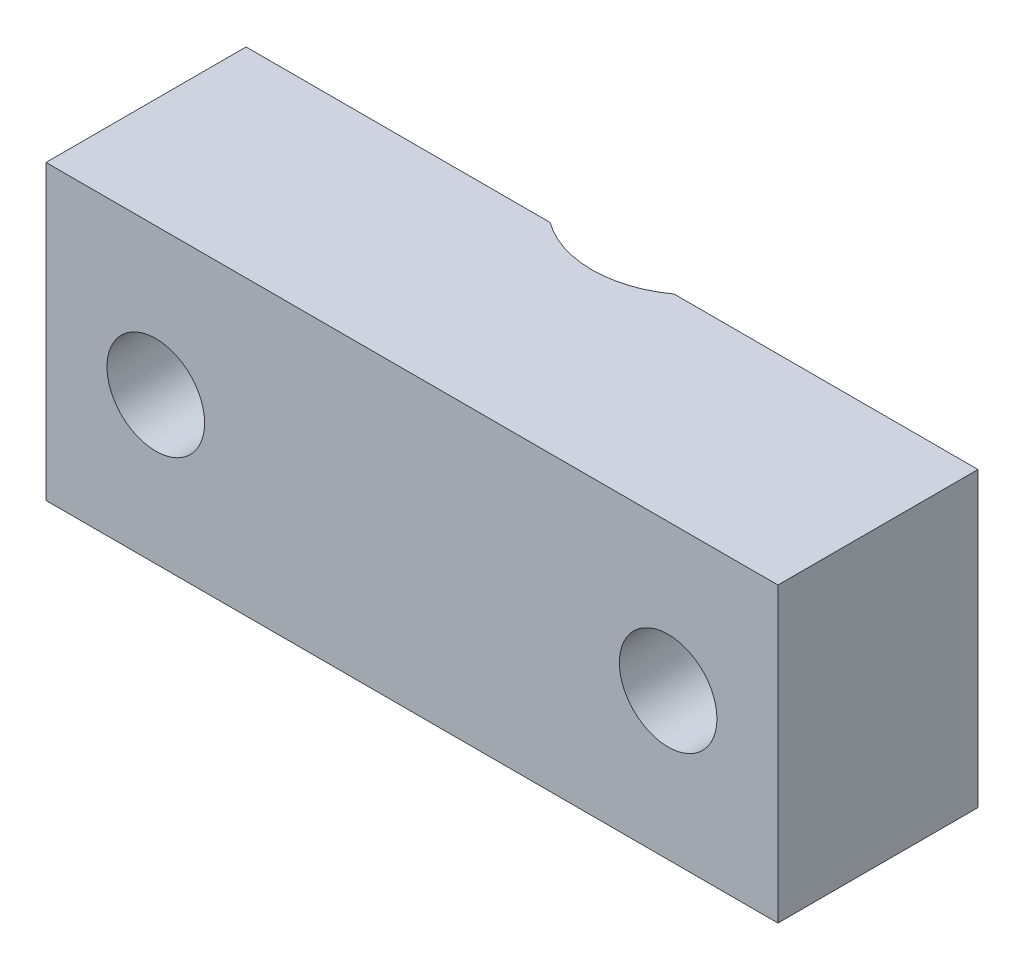
ISO-10303-21;
HEADER;
FILE_DESCRIPTION(('STEP AP214'),'2;1');
FILE_NAME('part.step','',(''),(''),'','','');
FILE_SCHEMA(('AUTOMOTIVE_DESIGN { 1 0 10303 214 1 1 1 1 }'));
ENDSEC;
DATA;
#1=APPLICATION_CONTEXT('core data for automotive mechanical design processes');
#2=APPLICATION_PROTOCOL_DEFINITION('international standard','automotive_design',2000,#1);
#3=PRODUCT_CONTEXT('',#1,'mechanical');
#4=PRODUCT('Part','Part','',(#3));
#5=PRODUCT_RELATED_PRODUCT_CATEGORY('part','',(#4));
#6=PRODUCT_DEFINITION_FORMATION('','',#4);
#7=PRODUCT_DEFINITION_CONTEXT('part definition',#1,'design');
#8=PRODUCT_DEFINITION('design','',#6,#7);
#9=PRODUCT_DEFINITION_SHAPE('','',#8);
#10=(LENGTH_UNIT() NAMED_UNIT(*) SI_UNIT(.MILLI.,.METRE.));
#11=(NAMED_UNIT(*) PLANE_ANGLE_UNIT() SI_UNIT($,.RADIAN.));
#12=(NAMED_UNIT(*) SI_UNIT($,.STERADIAN.) SOLID_ANGLE_UNIT());
#13=UNCERTAINTY_MEASURE_WITH_UNIT(LENGTH_MEASURE(1.E-05),#10,'distance_accuracy_value','');
#14=(GEOMETRIC_REPRESENTATION_CONTEXT(3) GLOBAL_UNCERTAINTY_ASSIGNED_CONTEXT((#13)) GLOBAL_UNIT_ASSIGNED_CONTEXT((#10,
#11,#12)) REPRESENTATION_CONTEXT('',''));
#15=CARTESIAN_POINT('',(0.,0.,0.));
#16=DIRECTION('',(0.,0.,1.));
#17=DIRECTION('',(1.,0.,0.));
#18=AXIS2_PLACEMENT_3D('',#15,#16,#17);
#19=CARTESIAN_POINT('',(0.,0.,0.));
#20=DIRECTION('',(0.,0.,1.));
#21=DIRECTION('',(1.,0.,0.));
#22=AXIS2_PLACEMENT_3D('',#19,#20,#21);
#23=PLANE('',#22);
#24=CARTESIAN_POINT('',(-22.1823149349453,31.5562188576654,0.));
#25=DIRECTION('',(0.,0.,1.));
#26=DIRECTION('',(1.,0.,0.));
#27=AXIS2_PLACEMENT_3D('',#24,#25,#26);
#28=CIRCLE('',#27,2.);
#29=CARTESIAN_POINT('',(-20.1823149349453,31.5562188576654,0.));
#30=VERTEX_POINT('',#29);
#31=EDGE_CURVE('E190',#30,#30,#28,.T.);
#32=ORIENTED_EDGE('',*,*,#31,.T.);
#33=EDGE_LOOP('',(#32));
#34=FACE_BOUND('',#33,.T.);
#35=DIRECTION('',(-1.,0.,0.));
#36=VECTOR('',#35,1.);
#37=CARTESIAN_POINT('',(3.31768506505468,37.5562188576654,0.));
#38=LINE('',#37,#36);
#39=CARTESIAN_POINT('',(-14.2231071342406,37.5562188576654,0.));
#40=VERTEX_POINT('',#39);
#41=CARTESIAN_POINT('',(-26.6823149349453,37.5562188576654,0.));
#42=VERTEX_POINT('',#41);
#43=EDGE_CURVE('E212',#40,#42,#38,.T.);
#44=ORIENTED_EDGE('',*,*,#43,.F.);
#45=DIRECTION('',(0.,-1.,0.));
#46=VECTOR('',#45,1.);
#47=CARTESIAN_POINT('',(-14.2231071342406,39.4562188576654,0.));
#48=LINE('',#47,#46);
#49=CARTESIAN_POINT('',(-14.2231071342406,35.4562188576654,0.));
#50=VERTEX_POINT('',#49);
#51=EDGE_CURVE('E156',#40,#50,#48,.T.);
#52=ORIENTED_EDGE('',*,*,#51,.T.);
#53=DIRECTION('',(1.,0.,0.));
#54=VECTOR('',#53,1.);
#55=CARTESIAN_POINT('',(0.,35.4562188576654,0.));
#56=LINE('',#55,#54);
#57=CARTESIAN_POINT('',(-15.7286095361824,35.4562188576654,0.));
#58=VERTEX_POINT('',#57);
#59=EDGE_CURVE('E239',#58,#50,#56,.T.);
#60=ORIENTED_EDGE('',*,*,#59,.F.);
#61=DIRECTION('',(0.,-1.,0.));
#62=VECTOR('',#61,1.);
#63=CARTESIAN_POINT('',(-15.7286095361824,35.4562188576654,0.));
#64=LINE('',#63,#62);
#65=CARTESIAN_POINT('',(-15.7286095361824,32.7562188576654,0.));
#66=VERTEX_POINT('',#65);
#67=EDGE_CURVE('E172',#58,#66,#64,.T.);
#68=ORIENTED_EDGE('',*,*,#67,.T.);
#69=DIRECTION('',(1.,0.,0.));
#70=VECTOR('',#69,1.);
#71=CARTESIAN_POINT('',(0.,32.7562188576654,0.));
#72=LINE('',#71,#70);
#73=CARTESIAN_POINT('',(-17.159540509997,32.7562188576654,0.));
#74=VERTEX_POINT('',#73);
#75=EDGE_CURVE('E233',#74,#66,#72,.T.);
#76=ORIENTED_EDGE('',*,*,#75,.F.);
#77=DIRECTION('',(0.,-1.,0.));
#78=VECTOR('',#77,1.);
#79=CARTESIAN_POINT('',(-17.159540509997,32.7562188576654,0.));
#80=LINE('',#79,#78);
#81=CARTESIAN_POINT('',(-17.159540509997,25.5562188576654,0.));
#82=VERTEX_POINT('',#81);
#83=EDGE_CURVE('E183',#74,#82,#80,.T.);
#84=ORIENTED_EDGE('',*,*,#83,.T.);
#85=DIRECTION('',(1.,0.,0.));
#86=VECTOR('',#85,1.);
#87=CARTESIAN_POINT('',(3.31768506505468,25.5562188576654,0.));
#88=LINE('',#87,#86);
#89=CARTESIAN_POINT('',(-26.6823149349453,25.5562188576654,0.));
#90=VERTEX_POINT('',#89);
#91=EDGE_CURVE('E203',#90,#82,#88,.T.);
#92=ORIENTED_EDGE('',*,*,#91,.F.);
#93=DIRECTION('',(0.,-1.,0.));
#94=VECTOR('',#93,1.);
#95=CARTESIAN_POINT('',(-26.6823149349453,25.5562188576654,0.));
#96=LINE('',#95,#94);
#97=EDGE_CURVE('E216',#42,#90,#96,.T.);
#98=ORIENTED_EDGE('',*,*,#97,.F.);
#99=EDGE_LOOP('',(#44,#52,#60,#68,#76,#84,#92,#98));
#100=FACE_BOUND('',#99,.T.);
#101=ADVANCED_FACE('F33',(#34,#100),#23,.F.);
#102=CARTESIAN_POINT('',(0.,0.,8.2));
#103=DIRECTION('',(0.,0.,1.));
#104=DIRECTION('',(1.,0.,0.));
#105=AXIS2_PLACEMENT_3D('',#102,#103,#104);
#106=PLANE('',#105);
#107=CARTESIAN_POINT('',(-22.1823149349453,31.5562188576654,8.2));
#108=DIRECTION('',(0.,0.,1.));
#109=DIRECTION('',(1.,0.,0.));
#110=AXIS2_PLACEMENT_3D('',#107,#108,#109);
#111=CIRCLE('',#110,2.);
#112=CARTESIAN_POINT('',(-20.1823149349453,31.5562188576654,8.2));
#113=VERTEX_POINT('',#112);
#114=EDGE_CURVE('E193',#113,#113,#111,.T.);
#115=ORIENTED_EDGE('',*,*,#114,.F.);
#116=EDGE_LOOP('',(#115));
#117=FACE_BOUND('',#116,.T.);
#118=DIRECTION('',(0.,1.,0.));
#119=VECTOR('',#118,1.);
#120=CARTESIAN_POINT('',(3.31768506505468,25.5562188576654,8.2));
#121=LINE('',#120,#119);
#122=CARTESIAN_POINT('',(3.31768506505468,25.5562188576654,8.2));
#123=VERTEX_POINT('',#122);
#124=CARTESIAN_POINT('',(3.31768506505468,37.5562188576654,8.2));
#125=VERTEX_POINT('',#124);
#126=EDGE_CURVE('E199',#123,#125,#121,.T.);
#127=ORIENTED_EDGE('',*,*,#126,.T.);
#128=DIRECTION('',(-1.,0.,0.));
#129=VECTOR('',#128,1.);
#130=CARTESIAN_POINT('',(3.31768506505468,37.5562188576654,8.2));
#131=LINE('',#130,#129);
#132=CARTESIAN_POINT('',(-26.6823149349453,37.5562188576654,8.2));
#133=VERTEX_POINT('',#132);
#134=EDGE_CURVE('E202',#125,#133,#131,.T.);
#135=ORIENTED_EDGE('',*,*,#134,.T.);
#136=DIRECTION('',(0.,-1.,0.));
#137=VECTOR('',#136,1.);
#138=CARTESIAN_POINT('',(-26.6823149349453,25.5562188576654,8.2));
#139=LINE('',#138,#137);
#140=CARTESIAN_POINT('',(-26.6823149349453,25.5562188576654,8.2));
#141=VERTEX_POINT('',#140);
#142=EDGE_CURVE('E205',#133,#141,#139,.T.);
#143=ORIENTED_EDGE('',*,*,#142,.T.);
#144=DIRECTION('',(1.,0.,0.));
#145=VECTOR('',#144,1.);
#146=CARTESIAN_POINT('',(3.31768506505468,25.5562188576654,8.2));
#147=LINE('',#146,#145);
#148=EDGE_CURVE('E207',#141,#123,#147,.T.);
#149=ORIENTED_EDGE('',*,*,#148,.T.);
#150=EDGE_LOOP('',(#127,#135,#143,#149));
#151=FACE_BOUND('',#150,.T.);
#152=CARTESIAN_POINT('',(-1.18231493494532,31.5562188576654,8.2));
#153=DIRECTION('',(0.,0.,1.));
#154=DIRECTION('',(1.,0.,0.));
#155=AXIS2_PLACEMENT_3D('',#152,#153,#154);
#156=CIRCLE('',#155,2.);
#157=CARTESIAN_POINT('',(0.817685065054685,31.5562188576654,8.2));
#158=VERTEX_POINT('',#157);
#159=EDGE_CURVE('E187',#158,#158,#156,.T.);
#160=ORIENTED_EDGE('',*,*,#159,.F.);
#161=EDGE_LOOP('',(#160));
#162=FACE_BOUND('',#161,.T.);
#163=ADVANCED_FACE('F271',(#117,#151,#162),#106,.T.);
#164=CARTESIAN_POINT('',(-9.14152273564999,35.4562188576654,0.));
#165=VERTEX_POINT('',#164);
#166=CARTESIAN_POINT('',(-7.63602033370828,35.4562188576654,0.));
#167=VERTEX_POINT('',#166);
#168=EDGE_CURVE('E238',#165,#167,#56,.T.);
#169=ORIENTED_EDGE('',*,*,#168,.F.);
#170=DIRECTION('',(0.,-1.,0.));
#171=VECTOR('',#170,1.);
#172=CARTESIAN_POINT('',(-9.14152273564999,39.4562188576654,0.));
#173=LINE('',#172,#171);
#174=CARTESIAN_POINT('',(-9.14152273564999,37.5562188576654,0.));
#175=VERTEX_POINT('',#174);
#176=EDGE_CURVE('E56',#165,#175,#173,.F.);
#177=ORIENTED_EDGE('',*,*,#176,.T.);
#178=CARTESIAN_POINT('',(3.31768506505468,37.5562188576654,0.));
#179=VERTEX_POINT('',#178);
#180=EDGE_CURVE('E213',#179,#175,#38,.T.);
#181=ORIENTED_EDGE('',*,*,#180,.F.);
#182=DIRECTION('',(0.,1.,0.));
#183=VECTOR('',#182,1.);
#184=CARTESIAN_POINT('',(3.31768506505468,25.5562188576654,0.));
#185=LINE('',#184,#183);
#186=CARTESIAN_POINT('',(3.31768506505468,25.5562188576654,0.));
#187=VERTEX_POINT('',#186);
#188=EDGE_CURVE('E196',#187,#179,#185,.T.);
#189=ORIENTED_EDGE('',*,*,#188,.F.);
#190=CARTESIAN_POINT('',(-6.20508935989366,25.5562188576654,0.));
#191=VERTEX_POINT('',#190);
#192=EDGE_CURVE('E218',#191,#187,#88,.T.);
#193=ORIENTED_EDGE('',*,*,#192,.F.);
#194=DIRECTION('',(0.,-1.,0.));
#195=VECTOR('',#194,1.);
#196=CARTESIAN_POINT('',(-6.20508935989365,32.7562188576654,0.));
#197=LINE('',#196,#195);
#198=CARTESIAN_POINT('',(-6.20508935989365,32.7562188576654,0.));
#199=VERTEX_POINT('',#198);
#200=EDGE_CURVE('E179',#191,#199,#197,.F.);
#201=ORIENTED_EDGE('',*,*,#200,.T.);
#202=CARTESIAN_POINT('',(-7.63602033370828,32.7562188576654,0.));
#203=VERTEX_POINT('',#202);
#204=EDGE_CURVE('E232',#203,#199,#72,.T.);
#205=ORIENTED_EDGE('',*,*,#204,.F.);
#206=DIRECTION('',(0.,-1.,0.));
#207=VECTOR('',#206,1.);
#208=CARTESIAN_POINT('',(-7.63602033370828,35.4562188576654,0.));
#209=LINE('',#208,#207);
#210=EDGE_CURVE('E169',#203,#167,#209,.F.);
#211=ORIENTED_EDGE('',*,*,#210,.T.);
#212=EDGE_LOOP('',(#169,#177,#181,#189,#193,#201,#205,#211));
#213=FACE_BOUND('',#212,.T.);
#214=CARTESIAN_POINT('',(-1.18231493494532,31.5562188576654,0.));
#215=DIRECTION('',(0.,0.,1.));
#216=DIRECTION('',(1.,0.,0.));
#217=AXIS2_PLACEMENT_3D('',#214,#215,#216);
#218=CIRCLE('',#217,2.);
#219=CARTESIAN_POINT('',(0.817685065054685,31.5562188576654,0.));
#220=VERTEX_POINT('',#219);
#221=EDGE_CURVE('E186',#220,#220,#218,.T.);
#222=ORIENTED_EDGE('',*,*,#221,.T.);
#223=EDGE_LOOP('',(#222));
#224=FACE_BOUND('',#223,.T.);
#225=ADVANCED_FACE('F274',(#213,#224),#23,.F.);
#226=CARTESIAN_POINT('',(3.31768506505468,25.5562188576654,8.2));
#227=DIRECTION('',(-1.,0.,0.));
#228=DIRECTION('',(0.,0.,1.));
#229=AXIS2_PLACEMENT_3D('',#226,#227,#228);
#230=PLANE('',#229);
#231=ORIENTED_EDGE('',*,*,#188,.T.);
#232=DIRECTION('',(0.,0.,-1.));
#233=VECTOR('',#232,1.);
#234=CARTESIAN_POINT('',(3.31768506505468,37.5562188576654,8.2));
#235=LINE('',#234,#233);
#236=EDGE_CURVE('E229',#125,#179,#235,.T.);
#237=ORIENTED_EDGE('',*,*,#236,.F.);
#238=ORIENTED_EDGE('',*,*,#126,.F.);
#239=DIRECTION('',(0.,0.,-1.));
#240=VECTOR('',#239,1.);
#241=CARTESIAN_POINT('',(3.31768506505468,25.5562188576654,8.2));
#242=LINE('',#241,#240);
#243=EDGE_CURVE('E209',#123,#187,#242,.T.);
#244=ORIENTED_EDGE('',*,*,#243,.T.);
#245=EDGE_LOOP('',(#231,#237,#238,#244));
#246=FACE_BOUND('',#245,.T.);
#247=ADVANCED_FACE('F35',(#246),#230,.F.);
#248=CARTESIAN_POINT('',(3.31768506505468,37.5562188576654,8.2));
#249=DIRECTION('',(0.,-1.,0.));
#250=DIRECTION('',(0.,0.,-1.));
#251=AXIS2_PLACEMENT_3D('',#248,#249,#250);
#252=PLANE('',#251);
#253=ORIENTED_EDGE('',*,*,#180,.T.);
#254=CARTESIAN_POINT('',(-11.6823149349453,37.5562188576654,-3.5));
#255=DIRECTION('',(0.,-1.,0.));
#256=DIRECTION('',(0.,0.,-1.));
#257=AXIS2_PLACEMENT_3D('',#254,#255,#256);
#258=CIRCLE('',#257,4.325);
#259=EDGE_CURVE('E163',#175,#40,#258,.T.);
#260=ORIENTED_EDGE('',*,*,#259,.T.);
#261=ORIENTED_EDGE('',*,*,#43,.T.);
#262=DIRECTION('',(0.,0.,-1.));
#263=VECTOR('',#262,1.);
#264=CARTESIAN_POINT('',(-26.6823149349453,37.5562188576654,8.2));
#265=LINE('',#264,#263);
#266=EDGE_CURVE('E226',#133,#42,#265,.T.);
#267=ORIENTED_EDGE('',*,*,#266,.F.);
#268=ORIENTED_EDGE('',*,*,#134,.F.);
#269=ORIENTED_EDGE('',*,*,#236,.T.);
#270=EDGE_LOOP('',(#253,#260,#261,#267,#268,#269));
#271=FACE_BOUND('',#270,.T.);
#272=ADVANCED_FACE('F287',(#271),#252,.F.);
#273=CARTESIAN_POINT('',(-26.6823149349453,25.5562188576654,8.2));
#274=DIRECTION('',(1.,0.,0.));
#275=DIRECTION('',(0.,0.,-1.));
#276=AXIS2_PLACEMENT_3D('',#273,#274,#275);
#277=PLANE('',#276);
#278=ORIENTED_EDGE('',*,*,#97,.T.);
#279=DIRECTION('',(0.,0.,-1.));
#280=VECTOR('',#279,1.);
#281=CARTESIAN_POINT('',(-26.6823149349453,25.5562188576654,8.2));
#282=LINE('',#281,#280);
#283=EDGE_CURVE('E223',#141,#90,#282,.T.);
#284=ORIENTED_EDGE('',*,*,#283,.F.);
#285=ORIENTED_EDGE('',*,*,#142,.F.);
#286=ORIENTED_EDGE('',*,*,#266,.T.);
#287=EDGE_LOOP('',(#278,#284,#285,#286));
#288=FACE_BOUND('',#287,.T.);
#289=ADVANCED_FACE('F370',(#288),#277,.F.);
#290=CARTESIAN_POINT('',(3.31768506505468,25.5562188576654,8.2));
#291=DIRECTION('',(0.,1.,0.));
#292=DIRECTION('',(0.,0.,1.));
#293=AXIS2_PLACEMENT_3D('',#290,#291,#292);
#294=PLANE('',#293);
#295=ORIENTED_EDGE('',*,*,#91,.T.);
#296=CARTESIAN_POINT('',(-11.6823149349453,25.5562188576654,-3.5));
#297=DIRECTION('',(0.,-1.,0.));
#298=DIRECTION('',(0.,0.,-1.));
#299=AXIS2_PLACEMENT_3D('',#296,#297,#298);
#300=CIRCLE('',#299,6.5);
#301=EDGE_CURVE('E175',#191,#82,#300,.T.);
#302=ORIENTED_EDGE('',*,*,#301,.F.);
#303=ORIENTED_EDGE('',*,*,#192,.T.);
#304=ORIENTED_EDGE('',*,*,#243,.F.);
#305=ORIENTED_EDGE('',*,*,#148,.F.);
#306=ORIENTED_EDGE('',*,*,#283,.T.);
#307=EDGE_LOOP('',(#295,#302,#303,#304,#305,#306));
#308=FACE_BOUND('',#307,.T.);
#309=ADVANCED_FACE('F305',(#308),#294,.F.);
#310=CARTESIAN_POINT('',(-22.1823149349453,31.5562188576654,8.2));
#311=DIRECTION('',(0.,0.,-1.));
#312=DIRECTION('',(-1.,0.,0.));
#313=AXIS2_PLACEMENT_3D('',#310,#311,#312);
#314=CYLINDRICAL_SURFACE('',#313,2.);
#315=ORIENTED_EDGE('',*,*,#114,.T.);
#316=EDGE_LOOP('',(#315));
#317=FACE_BOUND('',#316,.T.);
#318=ORIENTED_EDGE('',*,*,#31,.F.);
#319=EDGE_LOOP('',(#318));
#320=FACE_BOUND('',#319,.T.);
#321=ADVANCED_FACE('F296',(#317,#320),#314,.F.);
#322=CARTESIAN_POINT('',(-1.18231493494532,31.5562188576654,8.2));
#323=DIRECTION('',(0.,0.,-1.));
#324=DIRECTION('',(-1.,0.,0.));
#325=AXIS2_PLACEMENT_3D('',#322,#323,#324);
#326=CYLINDRICAL_SURFACE('',#325,2.);
#327=ORIENTED_EDGE('',*,*,#159,.T.);
#328=EDGE_LOOP('',(#327));
#329=FACE_BOUND('',#328,.T.);
#330=ORIENTED_EDGE('',*,*,#221,.F.);
#331=EDGE_LOOP('',(#330));
#332=FACE_BOUND('',#331,.T.);
#333=ADVANCED_FACE('F293',(#329,#332),#326,.F.);
#334=CARTESIAN_POINT('',(-11.6823149349453,32.7562188576654,-3.5));
#335=DIRECTION('',(0.,-1.,0.));
#336=DIRECTION('',(0.,0.,-1.));
#337=AXIS2_PLACEMENT_3D('',#334,#335,#336);
#338=PLANE('',#337);
#339=CARTESIAN_POINT('',(-11.6823149349453,32.7562188576654,-3.5));
#340=DIRECTION('',(0.,-1.,0.));
#341=DIRECTION('',(0.,0.,-1.));
#342=AXIS2_PLACEMENT_3D('',#339,#340,#341);
#343=CIRCLE('',#342,5.35);
#344=EDGE_CURVE('E236',#203,#66,#343,.T.);
#345=ORIENTED_EDGE('',*,*,#344,.F.);
#346=ORIENTED_EDGE('',*,*,#204,.T.);
#347=CARTESIAN_POINT('',(-11.6823149349453,32.7562188576654,-3.5));
#348=DIRECTION('',(0.,-1.,0.));
#349=DIRECTION('',(0.,0.,-1.));
#350=AXIS2_PLACEMENT_3D('',#347,#348,#349);
#351=CIRCLE('',#350,6.5);
#352=EDGE_CURVE('E176',#199,#74,#351,.T.);
#353=ORIENTED_EDGE('',*,*,#352,.T.);
#354=ORIENTED_EDGE('',*,*,#75,.T.);
#355=EDGE_LOOP('',(#345,#346,#353,#354));
#356=FACE_BOUND('',#355,.T.);
#357=ADVANCED_FACE('F295',(#356),#338,.T.);
#358=CARTESIAN_POINT('',(-11.6823149349453,32.7562188576654,-3.5));
#359=DIRECTION('',(0.,-1.,0.));
#360=DIRECTION('',(0.,0.,-1.));
#361=AXIS2_PLACEMENT_3D('',#358,#359,#360);
#362=CYLINDRICAL_SURFACE('',#361,6.5);
#363=DIRECTION('',(0.,-1.,0.));
#364=VECTOR('',#363,1.);
#365=CARTESIAN_POINT('',(-16.4830330604199,32.7562188576654,0.882134808485417));
#366=LINE('',#365,#364);
#367=CARTESIAN_POINT('',(-16.4830330604199,29.8562188576654,0.882134808485417));
#368=VERTEX_POINT('',#367);
#369=CARTESIAN_POINT('',(-16.4830330604199,31.2562188576654,0.882134808485417));
#370=VERTEX_POINT('',#369);
#371=EDGE_CURVE('E41',#368,#370,#366,.F.);
#372=ORIENTED_EDGE('',*,*,#371,.F.);
#373=CARTESIAN_POINT('',(-11.6823149349453,29.8562188576654,-3.5));
#374=DIRECTION('',(0.,-1.,0.));
#375=DIRECTION('',(0.,0.,-1.));
#376=AXIS2_PLACEMENT_3D('',#373,#374,#375);
#377=CIRCLE('',#376,6.5);
#378=CARTESIAN_POINT('',(-6.81381569244131,29.8562188576654,0.806705832273426));
#379=VERTEX_POINT('',#378);
#380=EDGE_CURVE('E11',#368,#379,#377,.F.);
#381=ORIENTED_EDGE('',*,*,#380,.T.);
#382=DIRECTION('',(0.,-1.,0.));
#383=VECTOR('',#382,1.);
#384=CARTESIAN_POINT('',(-6.81381569244132,32.7562188576654,0.806705832273429));
#385=LINE('',#384,#383);
#386=CARTESIAN_POINT('',(-6.81381569244131,31.2562188576654,0.806705832273426));
#387=VERTEX_POINT('',#386);
#388=EDGE_CURVE('E246',#387,#379,#385,.T.);
#389=ORIENTED_EDGE('',*,*,#388,.F.);
#390=CARTESIAN_POINT('',(-11.6823149349453,31.2562188576654,-3.5));
#391=DIRECTION('',(0.,-1.,0.));
#392=DIRECTION('',(0.,0.,-1.));
#393=AXIS2_PLACEMENT_3D('',#390,#391,#392);
#394=CIRCLE('',#393,6.5);
#395=EDGE_CURVE('E244',#370,#387,#394,.F.);
#396=ORIENTED_EDGE('',*,*,#395,.F.);
#397=EDGE_LOOP('',(#372,#381,#389,#396));
#398=FACE_BOUND('',#397,.T.);
#399=ORIENTED_EDGE('',*,*,#352,.F.);
#400=ORIENTED_EDGE('',*,*,#200,.F.);
#401=ORIENTED_EDGE('',*,*,#301,.T.);
#402=ORIENTED_EDGE('',*,*,#83,.F.);
#403=EDGE_LOOP('',(#399,#400,#401,#402));
#404=FACE_BOUND('',#403,.T.);
#405=ADVANCED_FACE('F250',(#398,#404),#362,.F.);
#406=CARTESIAN_POINT('',(-11.6823149349453,35.4562188576654,-3.5));
#407=DIRECTION('',(0.,-1.,0.));
#408=DIRECTION('',(0.,0.,-1.));
#409=AXIS2_PLACEMENT_3D('',#406,#407,#408);
#410=PLANE('',#409);
#411=CARTESIAN_POINT('',(-11.6823149349453,35.4562188576654,-3.5));
#412=DIRECTION('',(0.,-1.,0.));
#413=DIRECTION('',(0.,0.,-1.));
#414=AXIS2_PLACEMENT_3D('',#411,#412,#413);
#415=CIRCLE('',#414,4.325);
#416=EDGE_CURVE('E242',#165,#50,#415,.T.);
#417=ORIENTED_EDGE('',*,*,#416,.F.);
#418=ORIENTED_EDGE('',*,*,#168,.T.);
#419=CARTESIAN_POINT('',(-11.6823149349453,35.4562188576654,-3.5));
#420=DIRECTION('',(0.,-1.,0.));
#421=DIRECTION('',(0.,0.,-1.));
#422=AXIS2_PLACEMENT_3D('',#419,#420,#421);
#423=CIRCLE('',#422,5.35);
#424=EDGE_CURVE('E166',#167,#58,#423,.T.);
#425=ORIENTED_EDGE('',*,*,#424,.T.);
#426=ORIENTED_EDGE('',*,*,#59,.T.);
#427=EDGE_LOOP('',(#417,#418,#425,#426));
#428=FACE_BOUND('',#427,.T.);
#429=ADVANCED_FACE('F310',(#428),#410,.T.);
#430=CARTESIAN_POINT('',(-11.6823149349453,35.4562188576654,-3.5));
#431=DIRECTION('',(0.,-1.,0.));
#432=DIRECTION('',(0.,0.,-1.));
#433=AXIS2_PLACEMENT_3D('',#430,#431,#432);
#434=CYLINDRICAL_SURFACE('',#433,5.35);
#435=ORIENTED_EDGE('',*,*,#424,.F.);
#436=ORIENTED_EDGE('',*,*,#210,.F.);
#437=ORIENTED_EDGE('',*,*,#344,.T.);
#438=ORIENTED_EDGE('',*,*,#67,.F.);
#439=EDGE_LOOP('',(#435,#436,#437,#438));
#440=FACE_BOUND('',#439,.T.);
#441=ADVANCED_FACE('F312',(#440),#434,.F.);
#442=CARTESIAN_POINT('',(-11.6823149349453,39.4562188576654,-3.5));
#443=DIRECTION('',(0.,-1.,0.));
#444=DIRECTION('',(0.,0.,-1.));
#445=AXIS2_PLACEMENT_3D('',#442,#443,#444);
#446=CYLINDRICAL_SURFACE('',#445,4.325);
#447=ORIENTED_EDGE('',*,*,#176,.F.);
#448=ORIENTED_EDGE('',*,*,#416,.T.);
#449=ORIENTED_EDGE('',*,*,#51,.F.);
#450=ORIENTED_EDGE('',*,*,#259,.F.);
#451=EDGE_LOOP('',(#447,#448,#449,#450));
#452=FACE_BOUND('',#451,.T.);
#453=ADVANCED_FACE('F267',(#452),#446,.F.);
#454=CARTESIAN_POINT('',(-18.0086831213363,29.8562188576654,-1.19154362235811));
#455=DIRECTION('',(0.805486637212176,0.,-0.592613936110703));
#456=DIRECTION('',(-0.592613936110704,0.,-0.805486637212176));
#457=AXIS2_PLACEMENT_3D('',#454,#455,#456);
#458=PLANE('',#457);
#459=ORIENTED_EDGE('',*,*,#371,.T.);
#460=DIRECTION('',(-0.592613936110703,0.,-0.805486637212176));
#461=VECTOR('',#460,1.);
#462=CARTESIAN_POINT('',(-18.0086831213363,31.2562188576654,-1.19154362235811));
#463=LINE('',#462,#461);
#464=CARTESIAN_POINT('',(-14.0987748465502,31.2562188576654,4.12284180828954));
#465=VERTEX_POINT('',#464);
#466=EDGE_CURVE('E48',#465,#370,#463,.T.);
#467=ORIENTED_EDGE('',*,*,#466,.F.);
#468=DIRECTION('',(0.,1.,0.));
#469=VECTOR('',#468,1.);
#470=CARTESIAN_POINT('',(-14.0987748465502,29.8562188576654,4.12284180828954));
#471=LINE('',#470,#469);
#472=CARTESIAN_POINT('',(-14.0987748465502,29.8562188576654,4.12284180828954));
#473=VERTEX_POINT('',#472);
#474=EDGE_CURVE('E149',#473,#465,#471,.T.);
#475=ORIENTED_EDGE('',*,*,#474,.F.);
#476=DIRECTION('',(-0.592613936110703,0.,-0.805486637212176));
#477=VECTOR('',#476,1.);
#478=CARTESIAN_POINT('',(-18.0086831213363,29.8562188576654,-1.19154362235811));
#479=LINE('',#478,#477);
#480=EDGE_CURVE('E134',#473,#368,#479,.T.);
#481=ORIENTED_EDGE('',*,*,#480,.T.);
#482=EDGE_LOOP('',(#459,#467,#475,#481));
#483=FACE_BOUND('',#482,.T.);
#484=ADVANCED_FACE('F154',(#483),#458,.T.);
#485=CARTESIAN_POINT('',(-9.27012437131088,29.8562188576654,4.12863019841944));
#486=DIRECTION('',(-0.804063521200931,0.,-0.594543399487338));
#487=DIRECTION('',(-0.594543399487338,0.,0.804063521200931));
#488=AXIS2_PLACEMENT_3D('',#485,#486,#487);
#489=PLANE('',#488);
#490=ORIENTED_EDGE('',*,*,#388,.T.);
#491=DIRECTION('',(-0.594543399487338,0.,0.804063521200931));
#492=VECTOR('',#491,1.);
#493=CARTESIAN_POINT('',(-9.27012437131088,29.8562188576654,4.12863019841944));
#494=LINE('',#493,#492);
#495=CARTESIAN_POINT('',(-9.27012437131088,29.8562188576654,4.12863019841944));
#496=VERTEX_POINT('',#495);
#497=EDGE_CURVE('E142',#379,#496,#494,.T.);
#498=ORIENTED_EDGE('',*,*,#497,.T.);
#499=DIRECTION('',(0.,1.,0.));
#500=VECTOR('',#499,1.);
#501=CARTESIAN_POINT('',(-9.27012437131088,29.8562188576654,4.12863019841944));
#502=LINE('',#501,#500);
#503=CARTESIAN_POINT('',(-9.27012437131088,31.2562188576654,4.12863019841944));
#504=VERTEX_POINT('',#503);
#505=EDGE_CURVE('E151',#496,#504,#502,.T.);
#506=ORIENTED_EDGE('',*,*,#505,.T.);
#507=DIRECTION('',(-0.594543399487338,0.,0.804063521200931));
#508=VECTOR('',#507,1.);
#509=CARTESIAN_POINT('',(-9.27012437131088,31.2562188576654,4.12863019841944));
#510=LINE('',#509,#508);
#511=EDGE_CURVE('E152',#387,#504,#510,.T.);
#512=ORIENTED_EDGE('',*,*,#511,.F.);
#513=EDGE_LOOP('',(#490,#498,#506,#512));
#514=FACE_BOUND('',#513,.T.);
#515=ADVANCED_FACE('F255',(#514),#489,.T.);
#516=CARTESIAN_POINT('',(-11.6823149349137,29.8562188576654,2.34499999995742));
#517=DIRECTION('',(0.,-1.,0.));
#518=DIRECTION('',(0.,0.,-1.));
#519=AXIS2_PLACEMENT_3D('',#516,#517,#518);
#520=PLANE('',#519);
#521=ORIENTED_EDGE('',*,*,#480,.F.);
#522=CARTESIAN_POINT('',(-11.6823149349137,29.8562188576654,2.34499999995742));
#523=DIRECTION('',(0.,-1.,0.));
#524=DIRECTION('',(0.,0.,-1.));
#525=AXIS2_PLACEMENT_3D('',#522,#523,#524);
#526=CIRCLE('',#525,3.);
#527=EDGE_CURVE('E138',#496,#473,#526,.T.);
#528=ORIENTED_EDGE('',*,*,#527,.F.);
#529=ORIENTED_EDGE('',*,*,#497,.F.);
#530=ORIENTED_EDGE('',*,*,#380,.F.);
#531=EDGE_LOOP('',(#521,#528,#529,#530));
#532=FACE_BOUND('',#531,.T.);
#533=ADVANCED_FACE('F136',(#532),#520,.F.);
#534=CARTESIAN_POINT('',(-11.6823149349137,31.2562188576654,2.34499999995742));
#535=DIRECTION('',(0.,-1.,0.));
#536=DIRECTION('',(0.,0.,-1.));
#537=AXIS2_PLACEMENT_3D('',#534,#535,#536);
#538=PLANE('',#537);
#539=ORIENTED_EDGE('',*,*,#395,.T.);
#540=ORIENTED_EDGE('',*,*,#511,.T.);
#541=CARTESIAN_POINT('',(-11.6823149349137,31.2562188576654,2.34499999995742));
#542=DIRECTION('',(0.,-1.,0.));
#543=DIRECTION('',(0.,0.,-1.));
#544=AXIS2_PLACEMENT_3D('',#541,#542,#543);
#545=CIRCLE('',#544,3.);
#546=EDGE_CURVE('E256',#504,#465,#545,.T.);
#547=ORIENTED_EDGE('',*,*,#546,.T.);
#548=ORIENTED_EDGE('',*,*,#466,.T.);
#549=EDGE_LOOP('',(#539,#540,#547,#548));
#550=FACE_BOUND('',#549,.T.);
#551=ADVANCED_FACE('F253',(#550),#538,.T.);
#552=CARTESIAN_POINT('',(-11.6823149349137,29.8562188576654,2.34499999995742));
#553=DIRECTION('',(0.,1.,0.));
#554=DIRECTION('',(0.,0.,1.));
#555=AXIS2_PLACEMENT_3D('',#552,#553,#554);
#556=CYLINDRICAL_SURFACE('',#555,3.);
#557=ORIENTED_EDGE('',*,*,#546,.F.);
#558=ORIENTED_EDGE('',*,*,#505,.F.);
#559=ORIENTED_EDGE('',*,*,#527,.T.);
#560=ORIENTED_EDGE('',*,*,#474,.T.);
#561=EDGE_LOOP('',(#557,#558,#559,#560));
#562=FACE_BOUND('',#561,.T.);
#563=ADVANCED_FACE('F148',(#562),#556,.F.);
#564=CLOSED_SHELL('',(#101,#163,#225,#247,#272,#289,#309,#321,#333,#357,#405,#429,#441,#453,
#484,#515,#533,#551,#563));
#565=MANIFOLD_SOLID_BREP('B2',#564);
#566=ADVANCED_BREP_SHAPE_REPRESENTATION('',(#18,#565),#14);
#567=SHAPE_DEFINITION_REPRESENTATION(#9,#566);
ENDSEC;
END-ISO-10303-21;
